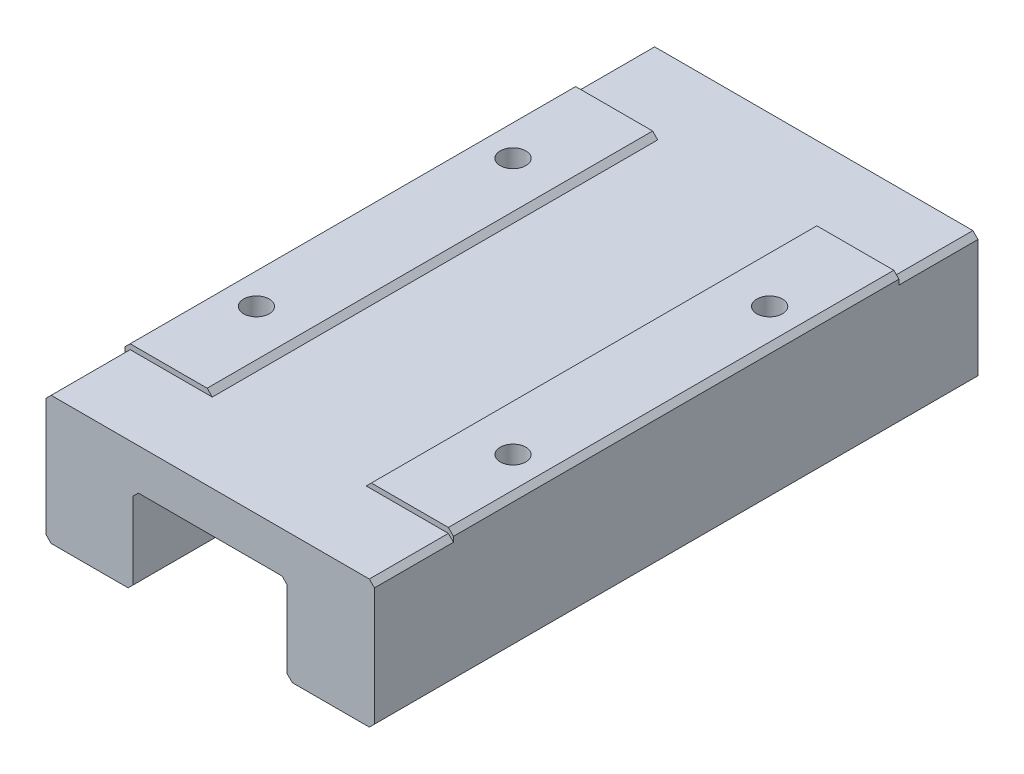
ISO-10303-21;
HEADER;
FILE_DESCRIPTION(('STEP AP214'),'2;1');
FILE_NAME('part.step','',(''),(''),'','','');
FILE_SCHEMA(('AUTOMOTIVE_DESIGN { 1 0 10303 214 1 1 1 1 }'));
ENDSEC;
DATA;
#1=APPLICATION_CONTEXT('core data for automotive mechanical design processes');
#2=APPLICATION_PROTOCOL_DEFINITION('international standard','automotive_design',2000,#1);
#3=PRODUCT_CONTEXT('',#1,'mechanical');
#4=PRODUCT('Part','Part','',(#3));
#5=PRODUCT_RELATED_PRODUCT_CATEGORY('part','',(#4));
#6=PRODUCT_DEFINITION_FORMATION('','',#4);
#7=PRODUCT_DEFINITION_CONTEXT('part definition',#1,'design');
#8=PRODUCT_DEFINITION('design','',#6,#7);
#9=PRODUCT_DEFINITION_SHAPE('','',#8);
#10=(LENGTH_UNIT() NAMED_UNIT(*) SI_UNIT(.MILLI.,.METRE.));
#11=(NAMED_UNIT(*) PLANE_ANGLE_UNIT() SI_UNIT($,.RADIAN.));
#12=(NAMED_UNIT(*) SI_UNIT($,.STERADIAN.) SOLID_ANGLE_UNIT());
#13=UNCERTAINTY_MEASURE_WITH_UNIT(LENGTH_MEASURE(1.E-05),#10,'distance_accuracy_value','');
#14=(GEOMETRIC_REPRESENTATION_CONTEXT(3) GLOBAL_UNCERTAINTY_ASSIGNED_CONTEXT((#13)) GLOBAL_UNIT_ASSIGNED_CONTEXT((#10,
#11,#12)) REPRESENTATION_CONTEXT('',''));
#15=CARTESIAN_POINT('',(0.,0.,0.));
#16=DIRECTION('',(0.,0.,1.));
#17=DIRECTION('',(1.,0.,0.));
#18=AXIS2_PLACEMENT_3D('',#15,#16,#17);
#19=CARTESIAN_POINT('',(0.,13.,0.));
#20=DIRECTION('',(0.,0.,-1.));
#21=DIRECTION('',(-1.,0.,0.));
#22=AXIS2_PLACEMENT_3D('',#19,#20,#21);
#23=PLANE('',#22);
#24=DIRECTION('',(1.,0.,0.));
#25=VECTOR('',#24,1.);
#26=CARTESIAN_POINT('',(0.,0.,0.));
#27=LINE('',#26,#25);
#28=CARTESIAN_POINT('',(24.,0.,0.));
#29=VERTEX_POINT('',#28);
#30=CARTESIAN_POINT('',(31.5,0.,0.));
#31=VERTEX_POINT('',#30);
#32=EDGE_CURVE('E415',#29,#31,#27,.T.);
#33=ORIENTED_EDGE('',*,*,#32,.T.);
#34=DIRECTION('',(-0.707106781186543,-0.707106781186552,0.));
#35=VECTOR('',#34,1.);
#36=CARTESIAN_POINT('',(32.,0.5,0.));
#37=LINE('',#36,#35);
#38=CARTESIAN_POINT('',(32.,0.500000000000004,0.));
#39=VERTEX_POINT('',#38);
#40=EDGE_CURVE('E520',#31,#39,#37,.F.);
#41=ORIENTED_EDGE('',*,*,#40,.T.);
#42=DIRECTION('',(0.,-1.,0.));
#43=VECTOR('',#42,1.);
#44=CARTESIAN_POINT('',(32.,13.,0.));
#45=LINE('',#44,#43);
#46=CARTESIAN_POINT('',(32.,12.,0.));
#47=VERTEX_POINT('',#46);
#48=EDGE_CURVE('E433',#47,#39,#45,.T.);
#49=ORIENTED_EDGE('',*,*,#48,.F.);
#50=DIRECTION('',(-0.707106781186547,0.707106781186547,0.));
#51=VECTOR('',#50,1.);
#52=CARTESIAN_POINT('',(31.5,12.5,0.));
#53=LINE('',#52,#51);
#54=CARTESIAN_POINT('',(31.5,12.5,0.));
#55=VERTEX_POINT('',#54);
#56=EDGE_CURVE('E508',#47,#55,#53,.T.);
#57=ORIENTED_EDGE('',*,*,#56,.T.);
#58=DIRECTION('',(1.,0.,0.));
#59=VECTOR('',#58,1.);
#60=CARTESIAN_POINT('',(0.,12.5,0.));
#61=LINE('',#60,#59);
#62=CARTESIAN_POINT('',(0.5,12.5,0.));
#63=VERTEX_POINT('',#62);
#64=EDGE_CURVE('E337',#63,#55,#61,.T.);
#65=ORIENTED_EDGE('',*,*,#64,.F.);
#66=DIRECTION('',(0.707106781186547,0.707106781186548,0.));
#67=VECTOR('',#66,1.);
#68=CARTESIAN_POINT('',(0.5,12.5,0.));
#69=LINE('',#68,#67);
#70=CARTESIAN_POINT('',(0.,12.,0.));
#71=VERTEX_POINT('',#70);
#72=EDGE_CURVE('E505',#63,#71,#69,.F.);
#73=ORIENTED_EDGE('',*,*,#72,.T.);
#74=DIRECTION('',(0.,-1.,0.));
#75=VECTOR('',#74,1.);
#76=CARTESIAN_POINT('',(0.,13.,0.));
#77=LINE('',#76,#75);
#78=CARTESIAN_POINT('',(0.,0.500000000000004,0.));
#79=VERTEX_POINT('',#78);
#80=EDGE_CURVE('E437',#71,#79,#77,.T.);
#81=ORIENTED_EDGE('',*,*,#80,.T.);
#82=DIRECTION('',(0.707106781186547,-0.707106781186548,0.));
#83=VECTOR('',#82,1.);
#84=CARTESIAN_POINT('',(0.5,0.,0.));
#85=LINE('',#84,#83);
#86=CARTESIAN_POINT('',(0.5,0.,0.));
#87=VERTEX_POINT('',#86);
#88=EDGE_CURVE('E511',#79,#87,#85,.T.);
#89=ORIENTED_EDGE('',*,*,#88,.T.);
#90=CARTESIAN_POINT('',(8.,0.,0.));
#91=VERTEX_POINT('',#90);
#92=EDGE_CURVE('E416',#87,#91,#27,.T.);
#93=ORIENTED_EDGE('',*,*,#92,.T.);
#94=DIRECTION('',(0.707106781186547,0.707106781186547,0.));
#95=VECTOR('',#94,1.);
#96=CARTESIAN_POINT('',(8.,0.,0.));
#97=LINE('',#96,#95);
#98=CARTESIAN_POINT('',(8.5,0.5,0.));
#99=VERTEX_POINT('',#98);
#100=EDGE_CURVE('E514',#91,#99,#97,.T.);
#101=ORIENTED_EDGE('',*,*,#100,.T.);
#102=DIRECTION('',(0.,1.,0.));
#103=VECTOR('',#102,1.);
#104=CARTESIAN_POINT('',(8.5,0.,0.));
#105=LINE('',#104,#103);
#106=CARTESIAN_POINT('',(8.5,7.99999999999999,0.));
#107=VERTEX_POINT('',#106);
#108=EDGE_CURVE('E365',#99,#107,#105,.T.);
#109=ORIENTED_EDGE('',*,*,#108,.T.);
#110=DIRECTION('',(-0.707106781186548,-0.707106781186548,0.));
#111=VECTOR('',#110,1.);
#112=CARTESIAN_POINT('',(6.75000000000001,6.24999999999999,0.));
#113=LINE('',#112,#111);
#114=CARTESIAN_POINT('',(9.00000000000001,8.5,0.));
#115=VERTEX_POINT('',#114);
#116=EDGE_CURVE('E599',#107,#115,#113,.F.);
#117=ORIENTED_EDGE('',*,*,#116,.T.);
#118=DIRECTION('',(1.,0.,0.));
#119=VECTOR('',#118,1.);
#120=CARTESIAN_POINT('',(0.,8.5,0.));
#121=LINE('',#120,#119);
#122=CARTESIAN_POINT('',(23.,8.5,0.));
#123=VERTEX_POINT('',#122);
#124=EDGE_CURVE('E377',#115,#123,#121,.T.);
#125=ORIENTED_EDGE('',*,*,#124,.T.);
#126=DIRECTION('',(0.707106781186557,-0.707106781186538,0.));
#127=VECTOR('',#126,1.);
#128=CARTESIAN_POINT('',(9.24999999999968,22.2499999999999,0.));
#129=LINE('',#128,#127);
#130=CARTESIAN_POINT('',(23.5,8.,0.));
#131=VERTEX_POINT('',#130);
#132=EDGE_CURVE('E605',#123,#131,#129,.T.);
#133=ORIENTED_EDGE('',*,*,#132,.T.);
#134=DIRECTION('',(0.,1.,0.));
#135=VECTOR('',#134,1.);
#136=CARTESIAN_POINT('',(23.5,0.,0.));
#137=LINE('',#136,#135);
#138=CARTESIAN_POINT('',(23.5,0.5,0.));
#139=VERTEX_POINT('',#138);
#140=EDGE_CURVE('E351',#139,#131,#137,.T.);
#141=ORIENTED_EDGE('',*,*,#140,.F.);
#142=DIRECTION('',(-0.707106781186547,0.707106781186547,0.));
#143=VECTOR('',#142,1.);
#144=CARTESIAN_POINT('',(23.5,0.5,0.));
#145=LINE('',#144,#143);
#146=EDGE_CURVE('E517',#139,#29,#145,.F.);
#147=ORIENTED_EDGE('',*,*,#146,.T.);
#148=EDGE_LOOP('',(#33,#41,#49,#57,#65,#73,#81,#89,#93,#101,#109,#117,#125,#133,#141,#147));
#149=FACE_BOUND('',#148,.T.);
#150=ADVANCED_FACE('F48',(#149),#23,.F.);
#151=CARTESIAN_POINT('',(0.,13.,-58.8));
#152=DIRECTION('',(0.,0.,-1.));
#153=DIRECTION('',(-1.,0.,0.));
#154=AXIS2_PLACEMENT_3D('',#151,#152,#153);
#155=PLANE('',#154);
#156=DIRECTION('',(0.,-1.,0.));
#157=VECTOR('',#156,1.);
#158=CARTESIAN_POINT('',(32.,13.,-58.8));
#159=LINE('',#158,#157);
#160=CARTESIAN_POINT('',(32.,12.,-58.8));
#161=VERTEX_POINT('',#160);
#162=CARTESIAN_POINT('',(32.,0.500000000000004,-58.8));
#163=VERTEX_POINT('',#162);
#164=EDGE_CURVE('E429',#161,#163,#159,.T.);
#165=ORIENTED_EDGE('',*,*,#164,.T.);
#166=DIRECTION('',(0.707106781186543,0.707106781186552,0.));
#167=VECTOR('',#166,1.);
#168=CARTESIAN_POINT('',(22.2500000000002,-9.24999999999991,-58.8));
#169=LINE('',#168,#167);
#170=CARTESIAN_POINT('',(31.5,0.,-58.8));
#171=VERTEX_POINT('',#170);
#172=EDGE_CURVE('E496',#163,#171,#169,.F.);
#173=ORIENTED_EDGE('',*,*,#172,.T.);
#174=DIRECTION('',(1.,0.,0.));
#175=VECTOR('',#174,1.);
#176=CARTESIAN_POINT('',(0.,0.,-58.8));
#177=LINE('',#176,#175);
#178=CARTESIAN_POINT('',(24.,0.,-58.8));
#179=VERTEX_POINT('',#178);
#180=EDGE_CURVE('E420',#179,#171,#177,.T.);
#181=ORIENTED_EDGE('',*,*,#180,.F.);
#182=DIRECTION('',(0.707106781186547,-0.707106781186547,0.));
#183=VECTOR('',#182,1.);
#184=CARTESIAN_POINT('',(5.5,18.5,-58.8));
#185=LINE('',#184,#183);
#186=CARTESIAN_POINT('',(23.5,0.5,-58.8));
#187=VERTEX_POINT('',#186);
#188=EDGE_CURVE('E493',#179,#187,#185,.F.);
#189=ORIENTED_EDGE('',*,*,#188,.T.);
#190=DIRECTION('',(0.,1.,0.));
#191=VECTOR('',#190,1.);
#192=CARTESIAN_POINT('',(23.5,0.,-58.8));
#193=LINE('',#192,#191);
#194=CARTESIAN_POINT('',(23.5,8.,-58.8));
#195=VERTEX_POINT('',#194);
#196=EDGE_CURVE('E360',#187,#195,#193,.T.);
#197=ORIENTED_EDGE('',*,*,#196,.T.);
#198=DIRECTION('',(-0.707106781186557,0.707106781186538,0.));
#199=VECTOR('',#198,1.);
#200=CARTESIAN_POINT('',(23.,8.5,-58.8));
#201=LINE('',#200,#199);
#202=CARTESIAN_POINT('',(23.,8.5,-58.8));
#203=VERTEX_POINT('',#202);
#204=EDGE_CURVE('E608',#195,#203,#201,.T.);
#205=ORIENTED_EDGE('',*,*,#204,.T.);
#206=DIRECTION('',(1.,0.,0.));
#207=VECTOR('',#206,1.);
#208=CARTESIAN_POINT('',(0.,8.5,-58.8));
#209=LINE('',#208,#207);
#210=CARTESIAN_POINT('',(9.00000000000001,8.5,-58.8));
#211=VERTEX_POINT('',#210);
#212=EDGE_CURVE('E364',#211,#203,#209,.T.);
#213=ORIENTED_EDGE('',*,*,#212,.F.);
#214=DIRECTION('',(0.707106781186548,0.707106781186548,0.));
#215=VECTOR('',#214,1.);
#216=CARTESIAN_POINT('',(8.5,7.99999999999999,-58.8));
#217=LINE('',#216,#215);
#218=CARTESIAN_POINT('',(8.5,7.99999999999999,-58.8));
#219=VERTEX_POINT('',#218);
#220=EDGE_CURVE('E602',#211,#219,#217,.F.);
#221=ORIENTED_EDGE('',*,*,#220,.T.);
#222=DIRECTION('',(0.,1.,0.));
#223=VECTOR('',#222,1.);
#224=CARTESIAN_POINT('',(8.5,0.,-58.8));
#225=LINE('',#224,#223);
#226=CARTESIAN_POINT('',(8.5,0.5,-58.8));
#227=VERTEX_POINT('',#226);
#228=EDGE_CURVE('E369',#227,#219,#225,.T.);
#229=ORIENTED_EDGE('',*,*,#228,.F.);
#230=DIRECTION('',(-0.707106781186547,-0.707106781186547,0.));
#231=VECTOR('',#230,1.);
#232=CARTESIAN_POINT('',(10.5,2.5,-58.8));
#233=LINE('',#232,#231);
#234=CARTESIAN_POINT('',(8.,0.,-58.8));
#235=VERTEX_POINT('',#234);
#236=EDGE_CURVE('E490',#227,#235,#233,.T.);
#237=ORIENTED_EDGE('',*,*,#236,.T.);
#238=CARTESIAN_POINT('',(0.5,0.,-58.8));
#239=VERTEX_POINT('',#238);
#240=EDGE_CURVE('E421',#239,#235,#177,.T.);
#241=ORIENTED_EDGE('',*,*,#240,.F.);
#242=DIRECTION('',(-0.707106781186547,0.707106781186548,0.));
#243=VECTOR('',#242,1.);
#244=CARTESIAN_POINT('',(-6.25,6.75,-58.8));
#245=LINE('',#244,#243);
#246=CARTESIAN_POINT('',(0.,0.500000000000004,-58.8));
#247=VERTEX_POINT('',#246);
#248=EDGE_CURVE('E487',#239,#247,#245,.T.);
#249=ORIENTED_EDGE('',*,*,#248,.T.);
#250=DIRECTION('',(0.,-1.,0.));
#251=VECTOR('',#250,1.);
#252=CARTESIAN_POINT('',(0.,13.,-58.8));
#253=LINE('',#252,#251);
#254=CARTESIAN_POINT('',(0.,12.,-58.8));
#255=VERTEX_POINT('',#254);
#256=EDGE_CURVE('E425',#255,#247,#253,.T.);
#257=ORIENTED_EDGE('',*,*,#256,.F.);
#258=DIRECTION('',(-0.707106781186547,-0.707106781186548,0.));
#259=VECTOR('',#258,1.);
#260=CARTESIAN_POINT('',(0.5,12.5,-58.8));
#261=LINE('',#260,#259);
#262=CARTESIAN_POINT('',(0.5,12.5,-58.8));
#263=VERTEX_POINT('',#262);
#264=EDGE_CURVE('E484',#255,#263,#261,.F.);
#265=ORIENTED_EDGE('',*,*,#264,.T.);
#266=DIRECTION('',(-1.,0.,0.));
#267=VECTOR('',#266,1.);
#268=CARTESIAN_POINT('',(0.,12.5,-58.8));
#269=LINE('',#268,#267);
#270=CARTESIAN_POINT('',(31.5,12.5,-58.8));
#271=VERTEX_POINT('',#270);
#272=EDGE_CURVE('E348',#271,#263,#269,.T.);
#273=ORIENTED_EDGE('',*,*,#272,.F.);
#274=DIRECTION('',(0.707106781186547,-0.707106781186547,0.));
#275=VECTOR('',#274,1.);
#276=CARTESIAN_POINT('',(15.5,28.5,-58.8));
#277=LINE('',#276,#275);
#278=EDGE_CURVE('E481',#271,#161,#277,.T.);
#279=ORIENTED_EDGE('',*,*,#278,.T.);
#280=EDGE_LOOP('',(#165,#173,#181,#189,#197,#205,#213,#221,#229,#237,#241,#249,#257,#265,#273,#279));
#281=FACE_BOUND('',#280,.T.);
#282=ADVANCED_FACE('F697',(#281),#155,.T.);
#283=CARTESIAN_POINT('',(0.,13.,0.));
#284=DIRECTION('',(-1.,0.,0.));
#285=DIRECTION('',(0.,0.,1.));
#286=AXIS2_PLACEMENT_3D('',#283,#284,#285);
#287=PLANE('',#286);
#288=ORIENTED_EDGE('',*,*,#256,.T.);
#289=DIRECTION('',(0.,0.,1.));
#290=VECTOR('',#289,1.);
#291=CARTESIAN_POINT('',(0.,0.5,0.));
#292=LINE('',#291,#290);
#293=EDGE_CURVE('E550',#247,#79,#292,.T.);
#294=ORIENTED_EDGE('',*,*,#293,.T.);
#295=ORIENTED_EDGE('',*,*,#80,.F.);
#296=DIRECTION('',(0.,0.,-1.));
#297=VECTOR('',#296,1.);
#298=CARTESIAN_POINT('',(0.,12.,0.));
#299=LINE('',#298,#297);
#300=CARTESIAN_POINT('',(0.,12.,-7.7));
#301=VERTEX_POINT('',#300);
#302=EDGE_CURVE('E539',#71,#301,#299,.T.);
#303=ORIENTED_EDGE('',*,*,#302,.T.);
#304=DIRECTION('',(0.,1.,0.));
#305=VECTOR('',#304,1.);
#306=CARTESIAN_POINT('',(0.,12.5,-7.7));
#307=LINE('',#306,#305);
#308=CARTESIAN_POINT('',(0.,12.5,-7.7));
#309=VERTEX_POINT('',#308);
#310=EDGE_CURVE('E535',#301,#309,#307,.T.);
#311=ORIENTED_EDGE('',*,*,#310,.T.);
#312=DIRECTION('',(0.,0.,-1.));
#313=VECTOR('',#312,1.);
#314=CARTESIAN_POINT('',(0.,12.5,0.));
#315=LINE('',#314,#313);
#316=CARTESIAN_POINT('',(0.,12.5,-51.1));
#317=VERTEX_POINT('',#316);
#318=EDGE_CURVE('E531',#309,#317,#315,.T.);
#319=ORIENTED_EDGE('',*,*,#318,.T.);
#320=DIRECTION('',(0.,1.,0.));
#321=VECTOR('',#320,1.);
#322=CARTESIAN_POINT('',(0.,12.5,-51.1));
#323=LINE('',#322,#321);
#324=CARTESIAN_POINT('',(0.,12.,-51.1));
#325=VERTEX_POINT('',#324);
#326=EDGE_CURVE('E543',#317,#325,#323,.F.);
#327=ORIENTED_EDGE('',*,*,#326,.T.);
#328=DIRECTION('',(0.,0.,-1.));
#329=VECTOR('',#328,1.);
#330=CARTESIAN_POINT('',(0.,12.,0.));
#331=LINE('',#330,#329);
#332=EDGE_CURVE('E547',#325,#255,#331,.T.);
#333=ORIENTED_EDGE('',*,*,#332,.T.);
#334=EDGE_LOOP('',(#288,#294,#295,#303,#311,#319,#327,#333));
#335=FACE_BOUND('',#334,.T.);
#336=ADVANCED_FACE('F641',(#335),#287,.T.);
#337=CARTESIAN_POINT('',(32.,13.,0.));
#338=DIRECTION('',(-1.,0.,0.));
#339=DIRECTION('',(0.,0.,1.));
#340=AXIS2_PLACEMENT_3D('',#337,#338,#339);
#341=PLANE('',#340);
#342=ORIENTED_EDGE('',*,*,#48,.T.);
#343=DIRECTION('',(0.,0.,-1.));
#344=VECTOR('',#343,1.);
#345=CARTESIAN_POINT('',(32.,0.5,0.));
#346=LINE('',#345,#344);
#347=EDGE_CURVE('E477',#39,#163,#346,.T.);
#348=ORIENTED_EDGE('',*,*,#347,.T.);
#349=ORIENTED_EDGE('',*,*,#164,.F.);
#350=DIRECTION('',(0.,0.,1.));
#351=VECTOR('',#350,1.);
#352=CARTESIAN_POINT('',(32.,12.,-51.1));
#353=LINE('',#352,#351);
#354=CARTESIAN_POINT('',(32.,12.,-51.1));
#355=VERTEX_POINT('',#354);
#356=EDGE_CURVE('E470',#161,#355,#353,.T.);
#357=ORIENTED_EDGE('',*,*,#356,.T.);
#358=DIRECTION('',(0.,1.,0.));
#359=VECTOR('',#358,1.);
#360=CARTESIAN_POINT('',(32.,12.5,-51.1));
#361=LINE('',#360,#359);
#362=CARTESIAN_POINT('',(32.,12.5,-51.1));
#363=VERTEX_POINT('',#362);
#364=EDGE_CURVE('E466',#355,#363,#361,.T.);
#365=ORIENTED_EDGE('',*,*,#364,.T.);
#366=DIRECTION('',(0.,0.,1.));
#367=VECTOR('',#366,1.);
#368=CARTESIAN_POINT('',(32.,12.5,-7.7));
#369=LINE('',#368,#367);
#370=CARTESIAN_POINT('',(32.,12.5,-7.7));
#371=VERTEX_POINT('',#370);
#372=EDGE_CURVE('E461',#363,#371,#369,.T.);
#373=ORIENTED_EDGE('',*,*,#372,.T.);
#374=DIRECTION('',(0.,1.,0.));
#375=VECTOR('',#374,1.);
#376=CARTESIAN_POINT('',(32.,12.5,-7.7));
#377=LINE('',#376,#375);
#378=CARTESIAN_POINT('',(32.,12.,-7.7));
#379=VERTEX_POINT('',#378);
#380=EDGE_CURVE('E67',#371,#379,#377,.F.);
#381=ORIENTED_EDGE('',*,*,#380,.T.);
#382=DIRECTION('',(0.,0.,1.));
#383=VECTOR('',#382,1.);
#384=CARTESIAN_POINT('',(32.,12.,0.));
#385=LINE('',#384,#383);
#386=EDGE_CURVE('E474',#379,#47,#385,.T.);
#387=ORIENTED_EDGE('',*,*,#386,.T.);
#388=EDGE_LOOP('',(#342,#348,#349,#357,#365,#373,#381,#387));
#389=FACE_BOUND('',#388,.T.);
#390=ADVANCED_FACE('F624',(#389),#341,.F.);
#391=CARTESIAN_POINT('',(0.,13.,0.));
#392=DIRECTION('',(0.,1.,0.));
#393=DIRECTION('',(0.,0.,1.));
#394=AXIS2_PLACEMENT_3D('',#391,#392,#393);
#395=PLANE('',#394);
#396=CARTESIAN_POINT('',(3.5,13.,-16.9999999999998));
#397=DIRECTION('',(0.,1.,0.));
#398=DIRECTION('',(0.,0.,1.));
#399=AXIS2_PLACEMENT_3D('',#396,#397,#398);
#400=CIRCLE('',#399,1.25);
#401=CARTESIAN_POINT('',(3.5,13.,-15.7499999999998));
#402=VERTEX_POINT('',#401);
#403=EDGE_CURVE('E407',#402,#402,#400,.T.);
#404=ORIENTED_EDGE('',*,*,#403,.F.);
#405=EDGE_LOOP('',(#404));
#406=FACE_BOUND('',#405,.T.);
#407=CARTESIAN_POINT('',(3.49999999999991,13.,-41.9999999999998));
#408=DIRECTION('',(0.,1.,0.));
#409=DIRECTION('',(0.,0.,1.));
#410=AXIS2_PLACEMENT_3D('',#407,#408,#409);
#411=CIRCLE('',#410,1.25);
#412=CARTESIAN_POINT('',(3.49999999999991,13.,-40.7499999999998));
#413=VERTEX_POINT('',#412);
#414=EDGE_CURVE('E399',#413,#413,#411,.T.);
#415=ORIENTED_EDGE('',*,*,#414,.F.);
#416=EDGE_LOOP('',(#415));
#417=FACE_BOUND('',#416,.T.);
#418=DIRECTION('',(1.,0.,0.));
#419=VECTOR('',#418,1.);
#420=CARTESIAN_POINT('',(0.,13.,-51.1));
#421=LINE('',#420,#419);
#422=CARTESIAN_POINT('',(0.5,13.,-51.1));
#423=VERTEX_POINT('',#422);
#424=CARTESIAN_POINT('',(7.99999999999999,13.,-51.1));
#425=VERTEX_POINT('',#424);
#426=EDGE_CURVE('E310',#423,#425,#421,.T.);
#427=ORIENTED_EDGE('',*,*,#426,.F.);
#428=DIRECTION('',(0.,0.,1.));
#429=VECTOR('',#428,1.);
#430=CARTESIAN_POINT('',(0.5,13.,0.));
#431=LINE('',#430,#429);
#432=CARTESIAN_POINT('',(0.5,13.,-7.7));
#433=VERTEX_POINT('',#432);
#434=EDGE_CURVE('E572',#423,#433,#431,.T.);
#435=ORIENTED_EDGE('',*,*,#434,.T.);
#436=DIRECTION('',(1.,0.,0.));
#437=VECTOR('',#436,1.);
#438=CARTESIAN_POINT('',(0.,13.,-7.7));
#439=LINE('',#438,#437);
#440=CARTESIAN_POINT('',(7.99999999999999,13.,-7.7));
#441=VERTEX_POINT('',#440);
#442=EDGE_CURVE('E359',#433,#441,#439,.T.);
#443=ORIENTED_EDGE('',*,*,#442,.T.);
#444=DIRECTION('',(0.,0.,-1.));
#445=VECTOR('',#444,1.);
#446=CARTESIAN_POINT('',(7.99999999999999,13.,-51.1));
#447=LINE('',#446,#445);
#448=EDGE_CURVE('E569',#441,#425,#447,.T.);
#449=ORIENTED_EDGE('',*,*,#448,.T.);
#450=EDGE_LOOP('',(#427,#435,#443,#449));
#451=FACE_BOUND('',#450,.T.);
#452=ADVANCED_FACE('F940',(#406,#417,#451),#395,.T.);
#453=CARTESIAN_POINT('',(0.,0.,0.));
#454=DIRECTION('',(0.,1.,0.));
#455=DIRECTION('',(0.,0.,1.));
#456=AXIS2_PLACEMENT_3D('',#453,#454,#455);
#457=PLANE('',#456);
#458=ORIENTED_EDGE('',*,*,#240,.T.);
#459=DIRECTION('',(0.,0.,1.));
#460=VECTOR('',#459,1.);
#461=CARTESIAN_POINT('',(8.,0.,0.));
#462=LINE('',#461,#460);
#463=EDGE_CURVE('E527',#235,#91,#462,.T.);
#464=ORIENTED_EDGE('',*,*,#463,.T.);
#465=ORIENTED_EDGE('',*,*,#92,.F.);
#466=DIRECTION('',(0.,0.,-1.));
#467=VECTOR('',#466,1.);
#468=CARTESIAN_POINT('',(0.5,0.,-58.8));
#469=LINE('',#468,#467);
#470=EDGE_CURVE('E523',#87,#239,#469,.T.);
#471=ORIENTED_EDGE('',*,*,#470,.T.);
#472=EDGE_LOOP('',(#458,#464,#465,#471));
#473=FACE_BOUND('',#472,.T.);
#474=ADVANCED_FACE('F649',(#473),#457,.F.);
#475=CARTESIAN_POINT('',(24.,13.,-7.7));
#476=VERTEX_POINT('',#475);
#477=CARTESIAN_POINT('',(31.5,13.,-7.7));
#478=VERTEX_POINT('',#477);
#479=EDGE_CURVE('E355',#476,#478,#439,.T.);
#480=ORIENTED_EDGE('',*,*,#479,.T.);
#481=DIRECTION('',(0.,0.,-1.));
#482=VECTOR('',#481,1.);
#483=CARTESIAN_POINT('',(31.5,13.,-51.1));
#484=LINE('',#483,#482);
#485=CARTESIAN_POINT('',(31.5,13.,-51.1));
#486=VERTEX_POINT('',#485);
#487=EDGE_CURVE('E583',#478,#486,#484,.T.);
#488=ORIENTED_EDGE('',*,*,#487,.T.);
#489=CARTESIAN_POINT('',(24.,13.,-51.1));
#490=VERTEX_POINT('',#489);
#491=EDGE_CURVE('E326',#490,#486,#421,.T.);
#492=ORIENTED_EDGE('',*,*,#491,.F.);
#493=DIRECTION('',(0.,0.,1.));
#494=VECTOR('',#493,1.);
#495=CARTESIAN_POINT('',(24.,13.,0.));
#496=LINE('',#495,#494);
#497=EDGE_CURVE('E579',#490,#476,#496,.T.);
#498=ORIENTED_EDGE('',*,*,#497,.T.);
#499=EDGE_LOOP('',(#480,#488,#492,#498));
#500=FACE_BOUND('',#499,.T.);
#501=CARTESIAN_POINT('',(28.5,13.,-17.));
#502=DIRECTION('',(0.,1.,0.));
#503=DIRECTION('',(0.,0.,1.));
#504=AXIS2_PLACEMENT_3D('',#501,#502,#503);
#505=CIRCLE('',#504,1.25);
#506=CARTESIAN_POINT('',(28.5,13.,-15.75));
#507=VERTEX_POINT('',#506);
#508=EDGE_CURVE('E373',#507,#507,#505,.T.);
#509=ORIENTED_EDGE('',*,*,#508,.F.);
#510=EDGE_LOOP('',(#509));
#511=FACE_BOUND('',#510,.T.);
#512=CARTESIAN_POINT('',(28.4999999999999,13.,-42.));
#513=DIRECTION('',(0.,1.,0.));
#514=DIRECTION('',(0.,0.,1.));
#515=AXIS2_PLACEMENT_3D('',#512,#513,#514);
#516=CIRCLE('',#515,1.25);
#517=CARTESIAN_POINT('',(28.4999999999999,13.,-40.75));
#518=VERTEX_POINT('',#517);
#519=EDGE_CURVE('E391',#518,#518,#516,.T.);
#520=ORIENTED_EDGE('',*,*,#519,.F.);
#521=EDGE_LOOP('',(#520));
#522=FACE_BOUND('',#521,.T.);
#523=ADVANCED_FACE('F716',(#500,#511,#522),#395,.T.);
#524=ORIENTED_EDGE('',*,*,#180,.T.);
#525=DIRECTION('',(0.,0.,1.));
#526=VECTOR('',#525,1.);
#527=CARTESIAN_POINT('',(31.5,0.,0.));
#528=LINE('',#527,#526);
#529=EDGE_CURVE('E502',#171,#31,#528,.T.);
#530=ORIENTED_EDGE('',*,*,#529,.T.);
#531=ORIENTED_EDGE('',*,*,#32,.F.);
#532=DIRECTION('',(0.,0.,-1.));
#533=VECTOR('',#532,1.);
#534=CARTESIAN_POINT('',(24.,0.,0.));
#535=LINE('',#534,#533);
#536=EDGE_CURVE('E499',#29,#179,#535,.T.);
#537=ORIENTED_EDGE('',*,*,#536,.T.);
#538=EDGE_LOOP('',(#524,#530,#531,#537));
#539=FACE_BOUND('',#538,.T.);
#540=ADVANCED_FACE('F687',(#539),#457,.F.);
#541=CARTESIAN_POINT('',(3.5,6.5,-16.9999999999998));
#542=DIRECTION('',(0.,1.,0.));
#543=DIRECTION('',(0.,0.,1.));
#544=AXIS2_PLACEMENT_3D('',#541,#542,#543);
#545=CONICAL_SURFACE('',#544,1.25,1.02974425867665);
#546=CARTESIAN_POINT('',(3.49999999999999,5.74892422621555,-16.9999999999998));
#547=VERTEX_POINT('',#546);
#548=VERTEX_LOOP('',#547);
#549=FACE_BOUND('',#548,.T.);
#550=CARTESIAN_POINT('',(3.5,6.5,-16.9999999999998));
#551=DIRECTION('',(0.,1.,0.));
#552=DIRECTION('',(0.,0.,1.));
#553=AXIS2_PLACEMENT_3D('',#550,#551,#552);
#554=CIRCLE('',#553,1.25);
#555=CARTESIAN_POINT('',(3.5,6.5,-15.7499999999998));
#556=VERTEX_POINT('',#555);
#557=EDGE_CURVE('E411',#556,#556,#554,.T.);
#558=ORIENTED_EDGE('',*,*,#557,.T.);
#559=EDGE_LOOP('',(#558));
#560=FACE_BOUND('',#559,.T.);
#561=ADVANCED_FACE('F929',(#549,#560),#545,.F.);
#562=CARTESIAN_POINT('',(3.5,13.,-16.9999999999998));
#563=DIRECTION('',(0.,1.,0.));
#564=DIRECTION('',(0.,0.,1.));
#565=AXIS2_PLACEMENT_3D('',#562,#563,#564);
#566=CYLINDRICAL_SURFACE('',#565,1.25);
#567=ORIENTED_EDGE('',*,*,#557,.F.);
#568=EDGE_LOOP('',(#567));
#569=FACE_BOUND('',#568,.T.);
#570=ORIENTED_EDGE('',*,*,#403,.T.);
#571=EDGE_LOOP('',(#570));
#572=FACE_BOUND('',#571,.T.);
#573=ADVANCED_FACE('F1042',(#569,#572),#566,.F.);
#574=CARTESIAN_POINT('',(3.49999999999991,6.5,-41.9999999999998));
#575=DIRECTION('',(0.,1.,0.));
#576=DIRECTION('',(0.,0.,1.));
#577=AXIS2_PLACEMENT_3D('',#574,#575,#576);
#578=CONICAL_SURFACE('',#577,1.25,1.02974425867665);
#579=CARTESIAN_POINT('',(3.49999999999991,5.74892422621555,-41.9999999999998));
#580=VERTEX_POINT('',#579);
#581=VERTEX_LOOP('',#580);
#582=FACE_BOUND('',#581,.T.);
#583=CARTESIAN_POINT('',(3.49999999999991,6.5,-41.9999999999998));
#584=DIRECTION('',(0.,1.,0.));
#585=DIRECTION('',(0.,0.,1.));
#586=AXIS2_PLACEMENT_3D('',#583,#584,#585);
#587=CIRCLE('',#586,1.25);
#588=CARTESIAN_POINT('',(3.49999999999991,6.5,-40.7499999999998));
#589=VERTEX_POINT('',#588);
#590=EDGE_CURVE('E403',#589,#589,#587,.T.);
#591=ORIENTED_EDGE('',*,*,#590,.T.);
#592=EDGE_LOOP('',(#591));
#593=FACE_BOUND('',#592,.T.);
#594=ADVANCED_FACE('F1030',(#582,#593),#578,.F.);
#595=CARTESIAN_POINT('',(3.49999999999991,13.,-41.9999999999998));
#596=DIRECTION('',(0.,1.,0.));
#597=DIRECTION('',(0.,0.,1.));
#598=AXIS2_PLACEMENT_3D('',#595,#596,#597);
#599=CYLINDRICAL_SURFACE('',#598,1.25);
#600=ORIENTED_EDGE('',*,*,#590,.F.);
#601=EDGE_LOOP('',(#600));
#602=FACE_BOUND('',#601,.T.);
#603=ORIENTED_EDGE('',*,*,#414,.T.);
#604=EDGE_LOOP('',(#603));
#605=FACE_BOUND('',#604,.T.);
#606=ADVANCED_FACE('F1020',(#602,#605),#599,.F.);
#607=CARTESIAN_POINT('',(28.4999999999999,6.5,-42.));
#608=DIRECTION('',(0.,1.,0.));
#609=DIRECTION('',(0.,0.,1.));
#610=AXIS2_PLACEMENT_3D('',#607,#608,#609);
#611=CONICAL_SURFACE('',#610,1.25,1.02974425867665);
#612=CARTESIAN_POINT('',(28.4999999999999,5.74892422621555,-42.));
#613=VERTEX_POINT('',#612);
#614=VERTEX_LOOP('',#613);
#615=FACE_BOUND('',#614,.T.);
#616=CARTESIAN_POINT('',(28.4999999999999,6.5,-42.));
#617=DIRECTION('',(0.,1.,0.));
#618=DIRECTION('',(0.,0.,1.));
#619=AXIS2_PLACEMENT_3D('',#616,#617,#618);
#620=CIRCLE('',#619,1.25);
#621=CARTESIAN_POINT('',(28.4999999999999,6.5,-40.75));
#622=VERTEX_POINT('',#621);
#623=EDGE_CURVE('E395',#622,#622,#620,.T.);
#624=ORIENTED_EDGE('',*,*,#623,.T.);
#625=EDGE_LOOP('',(#624));
#626=FACE_BOUND('',#625,.T.);
#627=ADVANCED_FACE('F1008',(#615,#626),#611,.F.);
#628=CARTESIAN_POINT('',(28.4999999999999,13.,-42.));
#629=DIRECTION('',(0.,1.,0.));
#630=DIRECTION('',(0.,0.,1.));
#631=AXIS2_PLACEMENT_3D('',#628,#629,#630);
#632=CYLINDRICAL_SURFACE('',#631,1.25);
#633=ORIENTED_EDGE('',*,*,#623,.F.);
#634=EDGE_LOOP('',(#633));
#635=FACE_BOUND('',#634,.T.);
#636=ORIENTED_EDGE('',*,*,#519,.T.);
#637=EDGE_LOOP('',(#636));
#638=FACE_BOUND('',#637,.T.);
#639=ADVANCED_FACE('F998',(#635,#638),#632,.F.);
#640=CARTESIAN_POINT('',(28.5,6.5,-17.));
#641=DIRECTION('',(0.,1.,0.));
#642=DIRECTION('',(0.,0.,1.));
#643=AXIS2_PLACEMENT_3D('',#640,#641,#642);
#644=CONICAL_SURFACE('',#643,1.25,1.02974425867665);
#645=CARTESIAN_POINT('',(28.5,5.74892422621555,-17.));
#646=VERTEX_POINT('',#645);
#647=VERTEX_LOOP('',#646);
#648=FACE_BOUND('',#647,.T.);
#649=CARTESIAN_POINT('',(28.5,6.5,-17.));
#650=DIRECTION('',(0.,1.,0.));
#651=DIRECTION('',(0.,0.,1.));
#652=AXIS2_PLACEMENT_3D('',#649,#650,#651);
#653=CIRCLE('',#652,1.25);
#654=CARTESIAN_POINT('',(28.5,6.5,-15.75));
#655=VERTEX_POINT('',#654);
#656=EDGE_CURVE('E387',#655,#655,#653,.T.);
#657=ORIENTED_EDGE('',*,*,#656,.T.);
#658=EDGE_LOOP('',(#657));
#659=FACE_BOUND('',#658,.T.);
#660=ADVANCED_FACE('F985',(#648,#659),#644,.F.);
#661=CARTESIAN_POINT('',(28.5,13.,-17.));
#662=DIRECTION('',(0.,1.,0.));
#663=DIRECTION('',(0.,0.,1.));
#664=AXIS2_PLACEMENT_3D('',#661,#662,#663);
#665=CYLINDRICAL_SURFACE('',#664,1.25);
#666=ORIENTED_EDGE('',*,*,#656,.F.);
#667=EDGE_LOOP('',(#666));
#668=FACE_BOUND('',#667,.T.);
#669=ORIENTED_EDGE('',*,*,#508,.T.);
#670=EDGE_LOOP('',(#669));
#671=FACE_BOUND('',#670,.T.);
#672=ADVANCED_FACE('F920',(#668,#671),#665,.F.);
#673=CARTESIAN_POINT('',(8.5,0.,-58.8));
#674=DIRECTION('',(1.,0.,0.));
#675=DIRECTION('',(0.,0.,-1.));
#676=AXIS2_PLACEMENT_3D('',#673,#674,#675);
#677=PLANE('',#676);
#678=ORIENTED_EDGE('',*,*,#228,.T.);
#679=DIRECTION('',(0.,0.,1.));
#680=VECTOR('',#679,1.);
#681=CARTESIAN_POINT('',(8.5,7.99999999999999,0.));
#682=LINE('',#681,#680);
#683=EDGE_CURVE('E444',#219,#107,#682,.T.);
#684=ORIENTED_EDGE('',*,*,#683,.T.);
#685=ORIENTED_EDGE('',*,*,#108,.F.);
#686=DIRECTION('',(0.,0.,-1.));
#687=VECTOR('',#686,1.);
#688=CARTESIAN_POINT('',(8.5,0.5,-58.8));
#689=LINE('',#688,#687);
#690=EDGE_CURVE('E441',#99,#227,#689,.T.);
#691=ORIENTED_EDGE('',*,*,#690,.T.);
#692=EDGE_LOOP('',(#678,#684,#685,#691));
#693=FACE_BOUND('',#692,.T.);
#694=ADVANCED_FACE('F658',(#693),#677,.T.);
#695=CARTESIAN_POINT('',(0.,8.5,-58.8));
#696=DIRECTION('',(0.,-1.,0.));
#697=DIRECTION('',(1.,0.,0.));
#698=AXIS2_PLACEMENT_3D('',#695,#696,#697);
#699=PLANE('',#698);
#700=ORIENTED_EDGE('',*,*,#124,.F.);
#701=DIRECTION('',(0.,0.,-1.));
#702=VECTOR('',#701,1.);
#703=CARTESIAN_POINT('',(9.00000000000001,8.5,-58.8));
#704=LINE('',#703,#702);
#705=EDGE_CURVE('E451',#115,#211,#704,.T.);
#706=ORIENTED_EDGE('',*,*,#705,.T.);
#707=ORIENTED_EDGE('',*,*,#212,.T.);
#708=DIRECTION('',(0.,0.,1.));
#709=VECTOR('',#708,1.);
#710=CARTESIAN_POINT('',(23.,8.5,-58.8));
#711=LINE('',#710,#709);
#712=EDGE_CURVE('E447',#203,#123,#711,.T.);
#713=ORIENTED_EDGE('',*,*,#712,.T.);
#714=EDGE_LOOP('',(#700,#706,#707,#713));
#715=FACE_BOUND('',#714,.T.);
#716=ADVANCED_FACE('F667',(#715),#699,.T.);
#717=CARTESIAN_POINT('',(23.5,0.,-58.8));
#718=DIRECTION('',(1.,0.,0.));
#719=DIRECTION('',(0.,0.,-1.));
#720=AXIS2_PLACEMENT_3D('',#717,#718,#719);
#721=PLANE('',#720);
#722=ORIENTED_EDGE('',*,*,#140,.T.);
#723=DIRECTION('',(0.,0.,-1.));
#724=VECTOR('',#723,1.);
#725=CARTESIAN_POINT('',(23.5,8.,-58.8));
#726=LINE('',#725,#724);
#727=EDGE_CURVE('E458',#131,#195,#726,.T.);
#728=ORIENTED_EDGE('',*,*,#727,.T.);
#729=ORIENTED_EDGE('',*,*,#196,.F.);
#730=DIRECTION('',(0.,0.,1.));
#731=VECTOR('',#730,1.);
#732=CARTESIAN_POINT('',(23.5,0.5,-58.8));
#733=LINE('',#732,#731);
#734=EDGE_CURVE('E454',#187,#139,#733,.T.);
#735=ORIENTED_EDGE('',*,*,#734,.T.);
#736=EDGE_LOOP('',(#722,#728,#729,#735));
#737=FACE_BOUND('',#736,.T.);
#738=ADVANCED_FACE('F676',(#737),#721,.F.);
#739=CARTESIAN_POINT('',(0.,12.5,-51.1));
#740=DIRECTION('',(0.,0.,1.));
#741=DIRECTION('',(1.,0.,0.));
#742=AXIS2_PLACEMENT_3D('',#739,#740,#741);
#743=PLANE('',#742);
#744=ORIENTED_EDGE('',*,*,#491,.T.);
#745=DIRECTION('',(0.707106781186543,-0.707106781186552,0.));
#746=VECTOR('',#745,1.);
#747=CARTESIAN_POINT('',(31.5,13.,-51.1));
#748=LINE('',#747,#746);
#749=EDGE_CURVE('E590',#486,#363,#748,.T.);
#750=ORIENTED_EDGE('',*,*,#749,.T.);
#751=ORIENTED_EDGE('',*,*,#364,.F.);
#752=DIRECTION('',(-0.707106781186548,0.707106781186548,0.));
#753=VECTOR('',#752,1.);
#754=CARTESIAN_POINT('',(15.75,28.25,-51.1));
#755=LINE('',#754,#753);
#756=CARTESIAN_POINT('',(31.5,12.5,-51.1));
#757=VERTEX_POINT('',#756);
#758=EDGE_CURVE('E614',#355,#757,#755,.T.);
#759=ORIENTED_EDGE('',*,*,#758,.T.);
#760=DIRECTION('',(1.,0.,0.));
#761=VECTOR('',#760,1.);
#762=CARTESIAN_POINT('',(0.,12.5,-51.1));
#763=LINE('',#762,#761);
#764=CARTESIAN_POINT('',(23.5,12.5,-51.1));
#765=VERTEX_POINT('',#764);
#766=EDGE_CURVE('E328',#765,#757,#763,.T.);
#767=ORIENTED_EDGE('',*,*,#766,.F.);
#768=DIRECTION('',(-0.707106781186543,-0.707106781186552,0.));
#769=VECTOR('',#768,1.);
#770=CARTESIAN_POINT('',(24.,13.,-51.1));
#771=LINE('',#770,#769);
#772=EDGE_CURVE('E587',#765,#490,#771,.F.);
#773=ORIENTED_EDGE('',*,*,#772,.T.);
#774=EDGE_LOOP('',(#744,#750,#751,#759,#767,#773));
#775=FACE_BOUND('',#774,.T.);
#776=ADVANCED_FACE('F709',(#775),#743,.F.);
#777=CARTESIAN_POINT('',(0.,12.5,-7.7));
#778=DIRECTION('',(0.,0.,1.));
#779=DIRECTION('',(1.,0.,0.));
#780=AXIS2_PLACEMENT_3D('',#777,#778,#779);
#781=PLANE('',#780);
#782=DIRECTION('',(1.,0.,0.));
#783=VECTOR('',#782,1.);
#784=CARTESIAN_POINT('',(0.,12.5,-7.7));
#785=LINE('',#784,#783);
#786=CARTESIAN_POINT('',(23.5,12.5,-7.7));
#787=VERTEX_POINT('',#786);
#788=CARTESIAN_POINT('',(31.5,12.5,-7.7));
#789=VERTEX_POINT('',#788);
#790=EDGE_CURVE('E339',#787,#789,#785,.T.);
#791=ORIENTED_EDGE('',*,*,#790,.T.);
#792=DIRECTION('',(0.707106781186548,-0.707106781186548,0.));
#793=VECTOR('',#792,1.);
#794=CARTESIAN_POINT('',(31.5,12.5,-7.7));
#795=LINE('',#794,#793);
#796=EDGE_CURVE('E57',#789,#379,#795,.T.);
#797=ORIENTED_EDGE('',*,*,#796,.T.);
#798=ORIENTED_EDGE('',*,*,#380,.F.);
#799=DIRECTION('',(-0.707106781186543,0.707106781186552,0.));
#800=VECTOR('',#799,1.);
#801=CARTESIAN_POINT('',(16.0000000000002,28.5,-7.7));
#802=LINE('',#801,#800);
#803=EDGE_CURVE('E596',#371,#478,#802,.T.);
#804=ORIENTED_EDGE('',*,*,#803,.T.);
#805=ORIENTED_EDGE('',*,*,#479,.F.);
#806=DIRECTION('',(0.707106781186543,0.707106781186552,0.));
#807=VECTOR('',#806,1.);
#808=CARTESIAN_POINT('',(11.7500000000002,0.750000000000002,-7.7));
#809=LINE('',#808,#807);
#810=EDGE_CURVE('E593',#476,#787,#809,.F.);
#811=ORIENTED_EDGE('',*,*,#810,.T.);
#812=EDGE_LOOP('',(#791,#797,#798,#804,#805,#811));
#813=FACE_BOUND('',#812,.T.);
#814=ADVANCED_FACE('F618',(#813),#781,.T.);
#815=ORIENTED_EDGE('',*,*,#442,.F.);
#816=DIRECTION('',(0.707106781186547,0.707106781186548,0.));
#817=VECTOR('',#816,1.);
#818=CARTESIAN_POINT('',(0.,12.5,-7.7));
#819=LINE('',#818,#817);
#820=EDGE_CURVE('E576',#433,#309,#819,.F.);
#821=ORIENTED_EDGE('',*,*,#820,.T.);
#822=ORIENTED_EDGE('',*,*,#310,.F.);
#823=DIRECTION('',(-0.707106781186547,-0.707106781186548,0.));
#824=VECTOR('',#823,1.);
#825=CARTESIAN_POINT('',(0.5,12.5,-7.7));
#826=LINE('',#825,#824);
#827=CARTESIAN_POINT('',(0.5,12.5,-7.7));
#828=VERTEX_POINT('',#827);
#829=EDGE_CURVE('E11',#301,#828,#826,.F.);
#830=ORIENTED_EDGE('',*,*,#829,.T.);
#831=CARTESIAN_POINT('',(8.49999999999999,12.5,-7.7));
#832=VERTEX_POINT('',#831);
#833=EDGE_CURVE('E332',#828,#832,#785,.T.);
#834=ORIENTED_EDGE('',*,*,#833,.T.);
#835=DIRECTION('',(-0.707106781186548,0.707106781186548,0.));
#836=VECTOR('',#835,1.);
#837=CARTESIAN_POINT('',(4.25,16.75,-7.7));
#838=LINE('',#837,#836);
#839=EDGE_CURVE('E329',#832,#441,#838,.T.);
#840=ORIENTED_EDGE('',*,*,#839,.T.);
#841=EDGE_LOOP('',(#815,#821,#822,#830,#834,#840));
#842=FACE_BOUND('',#841,.T.);
#843=ADVANCED_FACE('F865',(#842),#781,.T.);
#844=CARTESIAN_POINT('',(0.5,12.5,-51.1));
#845=VERTEX_POINT('',#844);
#846=CARTESIAN_POINT('',(8.49999999999999,12.5,-51.1));
#847=VERTEX_POINT('',#846);
#848=EDGE_CURVE('E308',#845,#847,#763,.T.);
#849=ORIENTED_EDGE('',*,*,#848,.F.);
#850=DIRECTION('',(0.707106781186547,0.707106781186548,0.));
#851=VECTOR('',#850,1.);
#852=CARTESIAN_POINT('',(0.25,12.25,-51.1));
#853=LINE('',#852,#851);
#854=EDGE_CURVE('E611',#845,#325,#853,.F.);
#855=ORIENTED_EDGE('',*,*,#854,.T.);
#856=ORIENTED_EDGE('',*,*,#326,.F.);
#857=DIRECTION('',(-0.707106781186547,-0.707106781186548,0.));
#858=VECTOR('',#857,1.);
#859=CARTESIAN_POINT('',(0.,12.5,-51.1));
#860=LINE('',#859,#858);
#861=EDGE_CURVE('E78',#317,#423,#860,.F.);
#862=ORIENTED_EDGE('',*,*,#861,.T.);
#863=ORIENTED_EDGE('',*,*,#426,.T.);
#864=DIRECTION('',(0.707106781186548,-0.707106781186548,0.));
#865=VECTOR('',#864,1.);
#866=CARTESIAN_POINT('',(8.49999999999999,12.5,-51.1));
#867=LINE('',#866,#865);
#868=EDGE_CURVE('E305',#425,#847,#867,.T.);
#869=ORIENTED_EDGE('',*,*,#868,.T.);
#870=EDGE_LOOP('',(#849,#855,#856,#862,#863,#869));
#871=FACE_BOUND('',#870,.T.);
#872=ADVANCED_FACE('F307',(#871),#743,.F.);
#873=CARTESIAN_POINT('',(0.,12.5,0.));
#874=DIRECTION('',(0.,1.,0.));
#875=DIRECTION('',(0.,0.,1.));
#876=AXIS2_PLACEMENT_3D('',#873,#874,#875);
#877=PLANE('',#876);
#878=ORIENTED_EDGE('',*,*,#272,.T.);
#879=DIRECTION('',(0.,0.,1.));
#880=VECTOR('',#879,1.);
#881=CARTESIAN_POINT('',(0.5,12.5,0.));
#882=LINE('',#881,#880);
#883=EDGE_CURVE('E315',#263,#845,#882,.T.);
#884=ORIENTED_EDGE('',*,*,#883,.T.);
#885=ORIENTED_EDGE('',*,*,#848,.T.);
#886=DIRECTION('',(0.,0.,1.));
#887=VECTOR('',#886,1.);
#888=CARTESIAN_POINT('',(8.5,12.5,0.));
#889=LINE('',#888,#887);
#890=EDGE_CURVE('E323',#847,#832,#889,.T.);
#891=ORIENTED_EDGE('',*,*,#890,.T.);
#892=ORIENTED_EDGE('',*,*,#833,.F.);
#893=DIRECTION('',(0.,0.,1.));
#894=VECTOR('',#893,1.);
#895=CARTESIAN_POINT('',(0.5,12.5,0.));
#896=LINE('',#895,#894);
#897=EDGE_CURVE('E553',#828,#63,#896,.T.);
#898=ORIENTED_EDGE('',*,*,#897,.T.);
#899=ORIENTED_EDGE('',*,*,#64,.T.);
#900=DIRECTION('',(0.,0.,-1.));
#901=VECTOR('',#900,1.);
#902=CARTESIAN_POINT('',(31.5,12.5,-7.7));
#903=LINE('',#902,#901);
#904=EDGE_CURVE('E557',#55,#789,#903,.T.);
#905=ORIENTED_EDGE('',*,*,#904,.T.);
#906=ORIENTED_EDGE('',*,*,#790,.F.);
#907=DIRECTION('',(0.,0.,1.));
#908=VECTOR('',#907,1.);
#909=CARTESIAN_POINT('',(23.5,12.5,0.));
#910=LINE('',#909,#908);
#911=EDGE_CURVE('E344',#765,#787,#910,.T.);
#912=ORIENTED_EDGE('',*,*,#911,.F.);
#913=ORIENTED_EDGE('',*,*,#766,.T.);
#914=DIRECTION('',(0.,0.,-1.));
#915=VECTOR('',#914,1.);
#916=CARTESIAN_POINT('',(31.5,12.5,-58.8));
#917=LINE('',#916,#915);
#918=EDGE_CURVE('E561',#757,#271,#917,.T.);
#919=ORIENTED_EDGE('',*,*,#918,.T.);
#920=EDGE_LOOP('',(#878,#884,#885,#891,#892,#898,#899,#905,#906,#912,#913,#919));
#921=FACE_BOUND('',#920,.T.);
#922=ADVANCED_FACE('F321',(#921),#877,.T.);
#923=CARTESIAN_POINT('',(8.5,7.99999999999999,-58.8));
#924=DIRECTION('',(0.707106781186548,-0.707106781186548,0.));
#925=DIRECTION('',(0.,0.,-1.));
#926=AXIS2_PLACEMENT_3D('',#923,#924,#925);
#927=PLANE('',#926);
#928=ORIENTED_EDGE('',*,*,#220,.F.);
#929=ORIENTED_EDGE('',*,*,#705,.F.);
#930=ORIENTED_EDGE('',*,*,#116,.F.);
#931=ORIENTED_EDGE('',*,*,#683,.F.);
#932=EDGE_LOOP('',(#928,#929,#930,#931));
#933=FACE_BOUND('',#932,.T.);
#934=ADVANCED_FACE('F663',(#933),#927,.T.);
#935=CARTESIAN_POINT('',(23.,8.5,-58.8));
#936=DIRECTION('',(0.707106781186538,0.707106781186557,0.));
#937=DIRECTION('',(0.,0.,1.));
#938=AXIS2_PLACEMENT_3D('',#935,#936,#937);
#939=PLANE('',#938);
#940=ORIENTED_EDGE('',*,*,#204,.F.);
#941=ORIENTED_EDGE('',*,*,#727,.F.);
#942=ORIENTED_EDGE('',*,*,#132,.F.);
#943=ORIENTED_EDGE('',*,*,#712,.F.);
#944=EDGE_LOOP('',(#940,#941,#942,#943));
#945=FACE_BOUND('',#944,.T.);
#946=ADVANCED_FACE('F672',(#945),#939,.F.);
#947=CARTESIAN_POINT('',(32.,0.5,0.));
#948=DIRECTION('',(-0.707106781186552,0.707106781186543,0.));
#949=DIRECTION('',(0.,0.,-1.));
#950=AXIS2_PLACEMENT_3D('',#947,#948,#949);
#951=PLANE('',#950);
#952=ORIENTED_EDGE('',*,*,#40,.F.);
#953=ORIENTED_EDGE('',*,*,#529,.F.);
#954=ORIENTED_EDGE('',*,*,#172,.F.);
#955=ORIENTED_EDGE('',*,*,#347,.F.);
#956=EDGE_LOOP('',(#952,#953,#954,#955));
#957=FACE_BOUND('',#956,.T.);
#958=ADVANCED_FACE('F692',(#957),#951,.F.);
#959=CARTESIAN_POINT('',(23.5,0.5,-58.8));
#960=DIRECTION('',(0.707106781186547,0.707106781186547,0.));
#961=DIRECTION('',(0.,0.,1.));
#962=AXIS2_PLACEMENT_3D('',#959,#960,#961);
#963=PLANE('',#962);
#964=ORIENTED_EDGE('',*,*,#188,.F.);
#965=ORIENTED_EDGE('',*,*,#536,.F.);
#966=ORIENTED_EDGE('',*,*,#146,.F.);
#967=ORIENTED_EDGE('',*,*,#734,.F.);
#968=EDGE_LOOP('',(#964,#965,#966,#967));
#969=FACE_BOUND('',#968,.T.);
#970=ADVANCED_FACE('F681',(#969),#963,.F.);
#971=CARTESIAN_POINT('',(8.,0.,0.));
#972=DIRECTION('',(0.707106781186547,-0.707106781186547,0.));
#973=DIRECTION('',(0.,0.,-1.));
#974=AXIS2_PLACEMENT_3D('',#971,#972,#973);
#975=PLANE('',#974);
#976=ORIENTED_EDGE('',*,*,#236,.F.);
#977=ORIENTED_EDGE('',*,*,#690,.F.);
#978=ORIENTED_EDGE('',*,*,#100,.F.);
#979=ORIENTED_EDGE('',*,*,#463,.F.);
#980=EDGE_LOOP('',(#976,#977,#978,#979));
#981=FACE_BOUND('',#980,.T.);
#982=ADVANCED_FACE('F654',(#981),#975,.T.);
#983=CARTESIAN_POINT('',(0.5,0.,0.));
#984=DIRECTION('',(-0.707106781186548,-0.707106781186547,0.));
#985=DIRECTION('',(0.,0.,1.));
#986=AXIS2_PLACEMENT_3D('',#983,#984,#985);
#987=PLANE('',#986);
#988=ORIENTED_EDGE('',*,*,#88,.F.);
#989=ORIENTED_EDGE('',*,*,#293,.F.);
#990=ORIENTED_EDGE('',*,*,#248,.F.);
#991=ORIENTED_EDGE('',*,*,#470,.F.);
#992=EDGE_LOOP('',(#988,#989,#990,#991));
#993=FACE_BOUND('',#992,.T.);
#994=ADVANCED_FACE('F645',(#993),#987,.T.);
#995=CARTESIAN_POINT('',(0.5,12.5,0.));
#996=DIRECTION('',(0.707106781186548,-0.707106781186547,0.));
#997=DIRECTION('',(0.,0.,1.));
#998=AXIS2_PLACEMENT_3D('',#995,#996,#997);
#999=PLANE('',#998);
#1000=ORIENTED_EDGE('',*,*,#264,.F.);
#1001=ORIENTED_EDGE('',*,*,#332,.F.);
#1002=ORIENTED_EDGE('',*,*,#854,.F.);
#1003=ORIENTED_EDGE('',*,*,#883,.F.);
#1004=EDGE_LOOP('',(#1000,#1001,#1002,#1003));
#1005=FACE_BOUND('',#1004,.T.);
#1006=ADVANCED_FACE('F751',(#1005),#999,.F.);
#1007=CARTESIAN_POINT('',(31.5,12.5,0.));
#1008=DIRECTION('',(0.707106781186547,0.707106781186547,0.));
#1009=DIRECTION('',(0.,0.,1.));
#1010=AXIS2_PLACEMENT_3D('',#1007,#1008,#1009);
#1011=PLANE('',#1010);
#1012=ORIENTED_EDGE('',*,*,#758,.F.);
#1013=ORIENTED_EDGE('',*,*,#356,.F.);
#1014=ORIENTED_EDGE('',*,*,#278,.F.);
#1015=ORIENTED_EDGE('',*,*,#918,.F.);
#1016=EDGE_LOOP('',(#1012,#1013,#1014,#1015));
#1017=FACE_BOUND('',#1016,.T.);
#1018=ADVANCED_FACE('F702',(#1017),#1011,.T.);
#1019=CARTESIAN_POINT('',(31.5,12.5,0.));
#1020=DIRECTION('',(0.707106781186547,0.707106781186547,0.));
#1021=DIRECTION('',(0.,0.,1.));
#1022=AXIS2_PLACEMENT_3D('',#1019,#1020,#1021);
#1023=PLANE('',#1022);
#1024=ORIENTED_EDGE('',*,*,#56,.F.);
#1025=ORIENTED_EDGE('',*,*,#386,.F.);
#1026=ORIENTED_EDGE('',*,*,#796,.F.);
#1027=ORIENTED_EDGE('',*,*,#904,.F.);
#1028=EDGE_LOOP('',(#1024,#1025,#1026,#1027));
#1029=FACE_BOUND('',#1028,.T.);
#1030=ADVANCED_FACE('F629',(#1029),#1023,.T.);
#1031=CARTESIAN_POINT('',(0.5,12.5,0.));
#1032=DIRECTION('',(0.707106781186548,-0.707106781186547,0.));
#1033=DIRECTION('',(0.,0.,1.));
#1034=AXIS2_PLACEMENT_3D('',#1031,#1032,#1033);
#1035=PLANE('',#1034);
#1036=ORIENTED_EDGE('',*,*,#829,.F.);
#1037=ORIENTED_EDGE('',*,*,#302,.F.);
#1038=ORIENTED_EDGE('',*,*,#72,.F.);
#1039=ORIENTED_EDGE('',*,*,#897,.F.);
#1040=EDGE_LOOP('',(#1036,#1037,#1038,#1039));
#1041=FACE_BOUND('',#1040,.T.);
#1042=ADVANCED_FACE('F636',(#1041),#1035,.F.);
#1043=CARTESIAN_POINT('',(0.,12.5,0.));
#1044=DIRECTION('',(0.707106781186548,-0.707106781186547,0.));
#1045=DIRECTION('',(0.,0.,-1.));
#1046=AXIS2_PLACEMENT_3D('',#1043,#1044,#1045);
#1047=PLANE('',#1046);
#1048=ORIENTED_EDGE('',*,*,#820,.F.);
#1049=ORIENTED_EDGE('',*,*,#434,.F.);
#1050=ORIENTED_EDGE('',*,*,#861,.F.);
#1051=ORIENTED_EDGE('',*,*,#318,.F.);
#1052=EDGE_LOOP('',(#1048,#1049,#1050,#1051));
#1053=FACE_BOUND('',#1052,.T.);
#1054=ADVANCED_FACE('F722',(#1053),#1047,.F.);
#1055=CARTESIAN_POINT('',(31.5,13.,0.));
#1056=DIRECTION('',(0.707106781186552,0.707106781186543,0.));
#1057=DIRECTION('',(0.,0.,1.));
#1058=AXIS2_PLACEMENT_3D('',#1055,#1056,#1057);
#1059=PLANE('',#1058);
#1060=ORIENTED_EDGE('',*,*,#803,.F.);
#1061=ORIENTED_EDGE('',*,*,#372,.F.);
#1062=ORIENTED_EDGE('',*,*,#749,.F.);
#1063=ORIENTED_EDGE('',*,*,#487,.F.);
#1064=EDGE_LOOP('',(#1060,#1061,#1062,#1063));
#1065=FACE_BOUND('',#1064,.T.);
#1066=ADVANCED_FACE('F720',(#1065),#1059,.T.);
#1067=CARTESIAN_POINT('',(24.,13.,0.));
#1068=DIRECTION('',(0.707106781186552,-0.707106781186543,0.));
#1069=DIRECTION('',(0.,0.,1.));
#1070=AXIS2_PLACEMENT_3D('',#1067,#1068,#1069);
#1071=PLANE('',#1070);
#1072=ORIENTED_EDGE('',*,*,#772,.F.);
#1073=ORIENTED_EDGE('',*,*,#911,.T.);
#1074=ORIENTED_EDGE('',*,*,#810,.F.);
#1075=ORIENTED_EDGE('',*,*,#497,.F.);
#1076=EDGE_LOOP('',(#1072,#1073,#1074,#1075));
#1077=FACE_BOUND('',#1076,.T.);
#1078=ADVANCED_FACE('F713',(#1077),#1071,.F.);
#1079=CARTESIAN_POINT('',(8.5,12.5,0.));
#1080=DIRECTION('',(0.707106781186547,0.707106781186547,0.));
#1081=DIRECTION('',(0.,0.,-1.));
#1082=AXIS2_PLACEMENT_3D('',#1079,#1080,#1081);
#1083=PLANE('',#1082);
#1084=ORIENTED_EDGE('',*,*,#868,.F.);
#1085=ORIENTED_EDGE('',*,*,#448,.F.);
#1086=ORIENTED_EDGE('',*,*,#839,.F.);
#1087=ORIENTED_EDGE('',*,*,#890,.F.);
#1088=EDGE_LOOP('',(#1084,#1085,#1086,#1087));
#1089=FACE_BOUND('',#1088,.T.);
#1090=ADVANCED_FACE('F50',(#1089),#1083,.T.);
#1091=CLOSED_SHELL('',(#150,#282,#336,#390,#452,#474,#523,#540,#561,#573,#594,#606,#627,#639,
#660,#672,#694,#716,#738,#776,#814,#843,#872,#922,#934,#946,#958,#970,#982,#994,#1006,#1018,
#1030,#1042,#1054,#1066,#1078,#1090));
#1092=MANIFOLD_SOLID_BREP('B2',#1091);
#1093=ADVANCED_BREP_SHAPE_REPRESENTATION('',(#18,#1092),#14);
#1094=SHAPE_DEFINITION_REPRESENTATION(#9,#1093);
ENDSEC;
END-ISO-10303-21;
